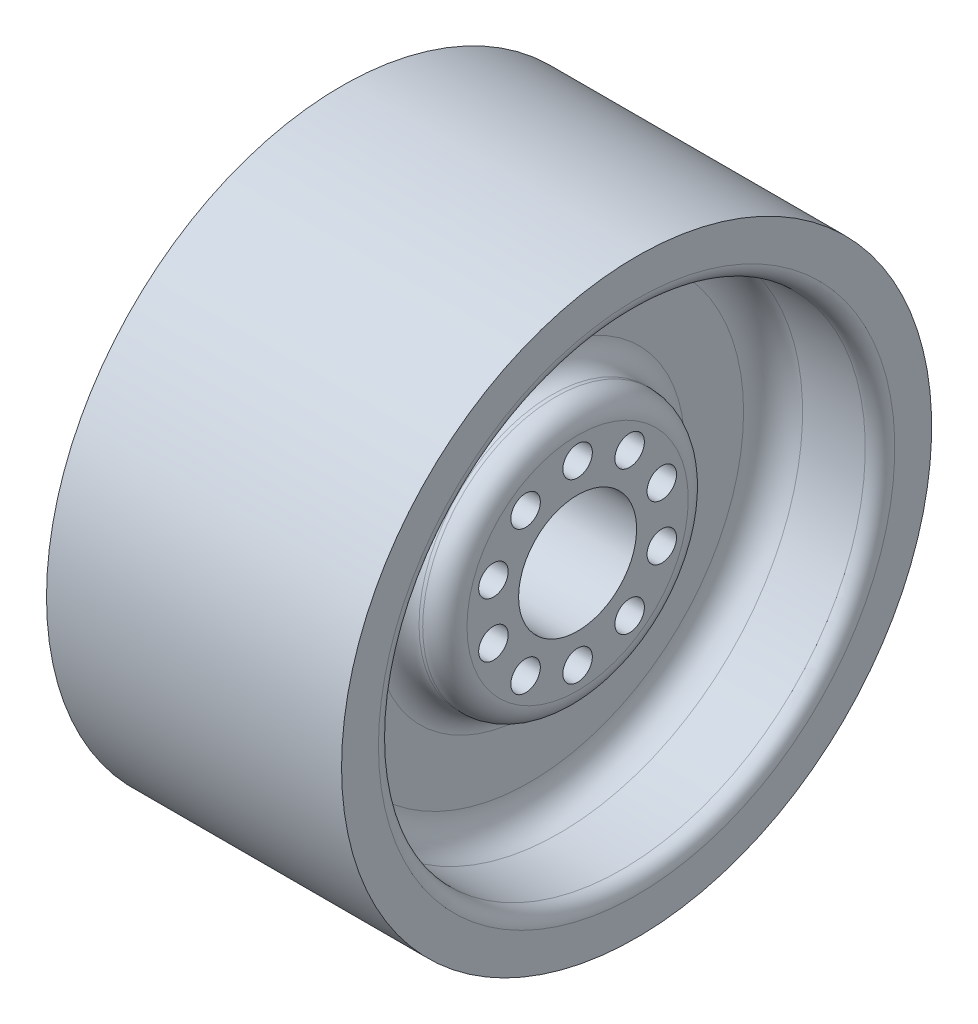
ISO-10303-21;
HEADER;
FILE_DESCRIPTION(('STEP AP214'),'2;1');
FILE_NAME('part.step','',(''),(''),'','','');
FILE_SCHEMA(('AUTOMOTIVE_DESIGN { 1 0 10303 214 1 1 1 1 }'));
ENDSEC;
DATA;
#1=APPLICATION_CONTEXT('core data for automotive mechanical design processes');
#2=APPLICATION_PROTOCOL_DEFINITION('international standard','automotive_design',2000,#1);
#3=PRODUCT_CONTEXT('',#1,'mechanical');
#4=PRODUCT('Part','Part','',(#3));
#5=PRODUCT_RELATED_PRODUCT_CATEGORY('part','',(#4));
#6=PRODUCT_DEFINITION_FORMATION('','',#4);
#7=PRODUCT_DEFINITION_CONTEXT('part definition',#1,'design');
#8=PRODUCT_DEFINITION('design','',#6,#7);
#9=PRODUCT_DEFINITION_SHAPE('','',#8);
#10=(LENGTH_UNIT() NAMED_UNIT(*) SI_UNIT(.MILLI.,.METRE.));
#11=(NAMED_UNIT(*) PLANE_ANGLE_UNIT() SI_UNIT($,.RADIAN.));
#12=(NAMED_UNIT(*) SI_UNIT($,.STERADIAN.) SOLID_ANGLE_UNIT());
#13=UNCERTAINTY_MEASURE_WITH_UNIT(LENGTH_MEASURE(1.E-05),#10,'distance_accuracy_value','');
#14=(GEOMETRIC_REPRESENTATION_CONTEXT(3) GLOBAL_UNCERTAINTY_ASSIGNED_CONTEXT((#13)) GLOBAL_UNIT_ASSIGNED_CONTEXT((#10,
#11,#12)) REPRESENTATION_CONTEXT('',''));
#15=CARTESIAN_POINT('',(0.,0.,0.));
#16=DIRECTION('',(0.,0.,1.));
#17=DIRECTION('',(1.,0.,0.));
#18=AXIS2_PLACEMENT_3D('',#15,#16,#17);
#19=CARTESIAN_POINT('',(40.,0.,0.));
#20=DIRECTION('',(-1.,0.,0.));
#21=DIRECTION('',(0.,0.,1.));
#22=AXIS2_PLACEMENT_3D('',#19,#20,#21);
#23=CYLINDRICAL_SURFACE('',#22,200.001);
#24=CARTESIAN_POINT('',(0.,0.,0.));
#25=DIRECTION('',(-1.,0.,0.));
#26=DIRECTION('',(0.,0.,1.));
#27=AXIS2_PLACEMENT_3D('',#24,#25,#26);
#28=CIRCLE('',#27,200.001);
#29=CARTESIAN_POINT('',(0.,0.,200.001));
#30=VERTEX_POINT('',#29);
#31=EDGE_CURVE('E10',#30,#30,#28,.T.);
#32=ORIENTED_EDGE('',*,*,#31,.F.);
#33=EDGE_LOOP('',(#32));
#34=FACE_BOUND('',#33,.T.);
#35=CARTESIAN_POINT('',(200.,0.,0.));
#36=DIRECTION('',(-1.,0.,0.));
#37=DIRECTION('',(0.,0.,1.));
#38=AXIS2_PLACEMENT_3D('',#35,#36,#37);
#39=CIRCLE('',#38,200.001);
#40=CARTESIAN_POINT('',(200.,0.,200.001));
#41=VERTEX_POINT('',#40);
#42=EDGE_CURVE('E98',#41,#41,#39,.T.);
#43=ORIENTED_EDGE('',*,*,#42,.T.);
#44=EDGE_LOOP('',(#43));
#45=FACE_BOUND('',#44,.T.);
#46=ADVANCED_FACE('F37',(#34,#45),#23,.T.);
#47=CARTESIAN_POINT('',(0.,200.001,0.));
#48=DIRECTION('',(1.,0.,0.));
#49=DIRECTION('',(0.,0.,-1.));
#50=AXIS2_PLACEMENT_3D('',#47,#48,#49);
#51=PLANE('',#50);
#52=CARTESIAN_POINT('',(0.,0.,0.));
#53=DIRECTION('',(-1.,0.,0.));
#54=DIRECTION('',(0.,0.,1.));
#55=AXIS2_PLACEMENT_3D('',#52,#53,#54);
#56=CIRCLE('',#55,175.001);
#57=CARTESIAN_POINT('',(0.,0.,175.001));
#58=VERTEX_POINT('',#57);
#59=EDGE_CURVE('E45',#58,#58,#56,.T.);
#60=ORIENTED_EDGE('',*,*,#59,.F.);
#61=EDGE_LOOP('',(#60));
#62=FACE_BOUND('',#61,.T.);
#63=ORIENTED_EDGE('',*,*,#31,.T.);
#64=EDGE_LOOP('',(#63));
#65=FACE_BOUND('',#64,.T.);
#66=ADVANCED_FACE('F173',(#62,#65),#51,.F.);
#67=CARTESIAN_POINT('',(10.,0.,0.));
#68=DIRECTION('',(-1.,0.,0.));
#69=DIRECTION('',(0.,0.,1.));
#70=AXIS2_PLACEMENT_3D('',#67,#68,#69);
#71=TOROIDAL_SURFACE('',#70,175.001,10.);
#72=CARTESIAN_POINT('',(10.,0.,0.));
#73=DIRECTION('',(-1.,0.,0.));
#74=DIRECTION('',(0.,0.,1.));
#75=AXIS2_PLACEMENT_3D('',#72,#73,#74);
#76=CIRCLE('',#75,165.001);
#77=CARTESIAN_POINT('',(10.,0.,165.001));
#78=VERTEX_POINT('',#77);
#79=EDGE_CURVE('E51',#78,#78,#76,.T.);
#80=ORIENTED_EDGE('',*,*,#79,.F.);
#81=EDGE_LOOP('',(#80));
#82=FACE_BOUND('',#81,.T.);
#83=ORIENTED_EDGE('',*,*,#59,.T.);
#84=EDGE_LOOP('',(#83));
#85=FACE_BOUND('',#84,.T.);
#86=ADVANCED_FACE('F170',(#82,#85),#71,.T.);
#87=CARTESIAN_POINT('',(40.,0.,0.));
#88=DIRECTION('',(-1.,0.,0.));
#89=DIRECTION('',(0.,0.,1.));
#90=AXIS2_PLACEMENT_3D('',#87,#88,#89);
#91=CYLINDRICAL_SURFACE('',#90,165.001);
#92=CARTESIAN_POINT('',(52.5,0.,0.));
#93=DIRECTION('',(-1.,0.,0.));
#94=DIRECTION('',(0.,0.,1.));
#95=AXIS2_PLACEMENT_3D('',#92,#93,#94);
#96=CIRCLE('',#95,165.001);
#97=CARTESIAN_POINT('',(52.5,0.,165.001));
#98=VERTEX_POINT('',#97);
#99=EDGE_CURVE('E161',#98,#98,#96,.T.);
#100=ORIENTED_EDGE('',*,*,#99,.F.);
#101=EDGE_LOOP('',(#100));
#102=FACE_BOUND('',#101,.T.);
#103=ORIENTED_EDGE('',*,*,#79,.T.);
#104=EDGE_LOOP('',(#103));
#105=FACE_BOUND('',#104,.T.);
#106=ADVANCED_FACE('F168',(#102,#105),#91,.F.);
#107=CARTESIAN_POINT('',(52.5,0.,0.));
#108=DIRECTION('',(-1.,0.,0.));
#109=DIRECTION('',(0.,0.,1.));
#110=AXIS2_PLACEMENT_3D('',#107,#108,#109);
#111=TOROIDAL_SURFACE('',#110,145.001,20.);
#112=CARTESIAN_POINT('',(72.5,0.,0.));
#113=DIRECTION('',(-1.,0.,0.));
#114=DIRECTION('',(0.,0.,1.));
#115=AXIS2_PLACEMENT_3D('',#112,#113,#114);
#116=CIRCLE('',#115,145.001);
#117=CARTESIAN_POINT('',(72.5,0.,145.001));
#118=VERTEX_POINT('',#117);
#119=EDGE_CURVE('E157',#118,#118,#116,.T.);
#120=ORIENTED_EDGE('',*,*,#119,.F.);
#121=EDGE_LOOP('',(#120));
#122=FACE_BOUND('',#121,.T.);
#123=ORIENTED_EDGE('',*,*,#99,.T.);
#124=EDGE_LOOP('',(#123));
#125=FACE_BOUND('',#124,.T.);
#126=ADVANCED_FACE('F185',(#122,#125),#111,.F.);
#127=CARTESIAN_POINT('',(72.5,145.001,0.));
#128=DIRECTION('',(1.,0.,0.));
#129=DIRECTION('',(0.,0.,-1.));
#130=AXIS2_PLACEMENT_3D('',#127,#128,#129);
#131=PLANE('',#130);
#132=CARTESIAN_POINT('',(72.4999999999999,0.,0.));
#133=DIRECTION('',(-1.,0.,0.));
#134=DIRECTION('',(0.,0.,1.));
#135=AXIS2_PLACEMENT_3D('',#132,#133,#134);
#136=CIRCLE('',#135,105.);
#137=CARTESIAN_POINT('',(72.4999999999999,0.,105.));
#138=VERTEX_POINT('',#137);
#139=EDGE_CURVE('E153',#138,#138,#136,.T.);
#140=ORIENTED_EDGE('',*,*,#139,.F.);
#141=EDGE_LOOP('',(#140));
#142=FACE_BOUND('',#141,.T.);
#143=ORIENTED_EDGE('',*,*,#119,.T.);
#144=EDGE_LOOP('',(#143));
#145=FACE_BOUND('',#144,.T.);
#146=ADVANCED_FACE('F189',(#142,#145),#131,.F.);
#147=CARTESIAN_POINT('',(57.4999999999999,0.,0.));
#148=DIRECTION('',(-1.,0.,0.));
#149=DIRECTION('',(0.,0.,1.));
#150=AXIS2_PLACEMENT_3D('',#147,#148,#149);
#151=TOROIDAL_SURFACE('',#150,105.,15.);
#152=CARTESIAN_POINT('',(57.4999999999999,0.,0.));
#153=DIRECTION('',(-1.,0.,0.));
#154=DIRECTION('',(0.,0.,1.));
#155=AXIS2_PLACEMENT_3D('',#152,#153,#154);
#156=CIRCLE('',#155,90.);
#157=CARTESIAN_POINT('',(57.4999999999999,0.,90.));
#158=VERTEX_POINT('',#157);
#159=EDGE_CURVE('E149',#158,#158,#156,.T.);
#160=ORIENTED_EDGE('',*,*,#159,.F.);
#161=EDGE_LOOP('',(#160));
#162=FACE_BOUND('',#161,.T.);
#163=ORIENTED_EDGE('',*,*,#139,.T.);
#164=EDGE_LOOP('',(#163));
#165=FACE_BOUND('',#164,.T.);
#166=ADVANCED_FACE('F193',(#162,#165),#151,.F.);
#167=CARTESIAN_POINT('',(40.,0.,0.));
#168=DIRECTION('',(-1.,0.,0.));
#169=DIRECTION('',(0.,0.,1.));
#170=AXIS2_PLACEMENT_3D('',#167,#168,#169);
#171=CYLINDRICAL_SURFACE('',#170,90.);
#172=CARTESIAN_POINT('',(55.,0.,0.));
#173=DIRECTION('',(-1.,0.,0.));
#174=DIRECTION('',(0.,0.,1.));
#175=AXIS2_PLACEMENT_3D('',#172,#173,#174);
#176=CIRCLE('',#175,90.);
#177=CARTESIAN_POINT('',(55.,0.,90.));
#178=VERTEX_POINT('',#177);
#179=EDGE_CURVE('E145',#178,#178,#176,.T.);
#180=ORIENTED_EDGE('',*,*,#179,.F.);
#181=EDGE_LOOP('',(#180));
#182=FACE_BOUND('',#181,.T.);
#183=ORIENTED_EDGE('',*,*,#159,.T.);
#184=EDGE_LOOP('',(#183));
#185=FACE_BOUND('',#184,.T.);
#186=ADVANCED_FACE('F197',(#182,#185),#171,.T.);
#187=CARTESIAN_POINT('',(55.,0.,0.));
#188=DIRECTION('',(-1.,0.,0.));
#189=DIRECTION('',(0.,0.,1.));
#190=AXIS2_PLACEMENT_3D('',#187,#188,#189);
#191=TOROIDAL_SURFACE('',#190,75.,15.);
#192=CARTESIAN_POINT('',(40.,0.,0.));
#193=DIRECTION('',(-1.,0.,0.));
#194=DIRECTION('',(0.,0.,1.));
#195=AXIS2_PLACEMENT_3D('',#192,#193,#194);
#196=CIRCLE('',#195,75.);
#197=CARTESIAN_POINT('',(40.,0.,75.));
#198=VERTEX_POINT('',#197);
#199=EDGE_CURVE('E141',#198,#198,#196,.T.);
#200=ORIENTED_EDGE('',*,*,#199,.F.);
#201=EDGE_LOOP('',(#200));
#202=FACE_BOUND('',#201,.T.);
#203=ORIENTED_EDGE('',*,*,#179,.T.);
#204=EDGE_LOOP('',(#203));
#205=FACE_BOUND('',#204,.T.);
#206=ADVANCED_FACE('F201',(#202,#205),#191,.T.);
#207=CARTESIAN_POINT('',(40.,75.,0.));
#208=DIRECTION('',(1.,0.,0.));
#209=DIRECTION('',(0.,0.,-1.));
#210=AXIS2_PLACEMENT_3D('',#207,#208,#209);
#211=PLANE('',#210);
#212=CARTESIAN_POINT('',(40.,-18.5410196624978,-57.0633909777089));
#213=DIRECTION('',(-1.,0.,0.));
#214=DIRECTION('',(0.,0.,1.));
#215=AXIS2_PLACEMENT_3D('',#212,#213,#214);
#216=CIRCLE('',#215,10.0000000000015);
#217=CARTESIAN_POINT('',(40.,-18.5410196624978,-47.0633909777074));
#218=VERTEX_POINT('',#217);
#219=EDGE_CURVE('E307',#218,#218,#216,.T.);
#220=ORIENTED_EDGE('',*,*,#219,.F.);
#221=EDGE_LOOP('',(#220));
#222=FACE_BOUND('',#221,.T.);
#223=CARTESIAN_POINT('',(40.,-48.5410196624977,-35.267115137548));
#224=DIRECTION('',(-1.,0.,0.));
#225=DIRECTION('',(0.,0.,1.));
#226=AXIS2_PLACEMENT_3D('',#223,#224,#225);
#227=CIRCLE('',#226,10.0000000000012);
#228=CARTESIAN_POINT('',(40.,-48.5410196624977,-25.2671151375468));
#229=VERTEX_POINT('',#228);
#230=EDGE_CURVE('E313',#229,#229,#227,.T.);
#231=ORIENTED_EDGE('',*,*,#230,.F.);
#232=EDGE_LOOP('',(#231));
#233=FACE_BOUND('',#232,.T.);
#234=CARTESIAN_POINT('',(40.,-60.0000000000008,4.7990859588068E-13));
#235=DIRECTION('',(-1.,0.,0.));
#236=DIRECTION('',(0.,0.,1.));
#237=AXIS2_PLACEMENT_3D('',#234,#235,#236);
#238=CIRCLE('',#237,10.0000000000006);
#239=CARTESIAN_POINT('',(40.,-60.0000000000008,10.0000000000011));
#240=VERTEX_POINT('',#239);
#241=EDGE_CURVE('E323',#240,#240,#238,.T.);
#242=ORIENTED_EDGE('',*,*,#241,.F.);
#243=EDGE_LOOP('',(#242));
#244=FACE_BOUND('',#243,.T.);
#245=CARTESIAN_POINT('',(40.,-48.5410196624981,35.2671151375493));
#246=DIRECTION('',(-1.,0.,0.));
#247=DIRECTION('',(0.,0.,1.));
#248=AXIS2_PLACEMENT_3D('',#245,#246,#247);
#249=CIRCLE('',#248,9.99999999999988);
#250=CARTESIAN_POINT('',(40.,-48.5410196624981,45.2671151375491));
#251=VERTEX_POINT('',#250);
#252=EDGE_CURVE('E318',#251,#251,#249,.T.);
#253=ORIENTED_EDGE('',*,*,#252,.F.);
#254=EDGE_LOOP('',(#253));
#255=FACE_BOUND('',#254,.T.);
#256=CARTESIAN_POINT('',(40.,-18.5410196624974,57.0633909777095));
#257=DIRECTION('',(-1.,0.,0.));
#258=DIRECTION('',(0.,0.,1.));
#259=AXIS2_PLACEMENT_3D('',#256,#257,#258);
#260=CIRCLE('',#259,9.99999999999973);
#261=CARTESIAN_POINT('',(40.,-18.5410196624974,67.0633909777092));
#262=VERTEX_POINT('',#261);
#263=EDGE_CURVE('E322',#262,#262,#260,.T.);
#264=ORIENTED_EDGE('',*,*,#263,.F.);
#265=EDGE_LOOP('',(#264));
#266=FACE_BOUND('',#265,.T.);
#267=CARTESIAN_POINT('',(40.,18.5410196624963,57.0633909777094));
#268=DIRECTION('',(-1.,0.,0.));
#269=DIRECTION('',(0.,0.,1.));
#270=AXIS2_PLACEMENT_3D('',#267,#268,#269);
#271=CIRCLE('',#270,9.99999999999963);
#272=CARTESIAN_POINT('',(40.,18.5410196624963,67.063390977709));
#273=VERTEX_POINT('',#272);
#274=EDGE_CURVE('E338',#273,#273,#271,.T.);
#275=ORIENTED_EDGE('',*,*,#274,.F.);
#276=EDGE_LOOP('',(#275));
#277=FACE_BOUND('',#276,.T.);
#278=CARTESIAN_POINT('',(40.,48.5410196624962,35.2671151375484));
#279=DIRECTION('',(-1.,0.,0.));
#280=DIRECTION('',(0.,0.,1.));
#281=AXIS2_PLACEMENT_3D('',#278,#279,#280);
#282=CIRCLE('',#281,9.99999999999983);
#283=CARTESIAN_POINT('',(40.,48.5410196624962,45.2671151375483));
#284=VERTEX_POINT('',#283);
#285=EDGE_CURVE('E334',#284,#284,#282,.T.);
#286=ORIENTED_EDGE('',*,*,#285,.F.);
#287=EDGE_LOOP('',(#286));
#288=FACE_BOUND('',#287,.T.);
#289=CARTESIAN_POINT('',(40.,59.9999999999992,0.));
#290=DIRECTION('',(-1.,0.,0.));
#291=DIRECTION('',(0.,0.,1.));
#292=AXIS2_PLACEMENT_3D('',#289,#290,#291);
#293=CIRCLE('',#292,10.0000000000002);
#294=CARTESIAN_POINT('',(40.,59.9999999999992,10.0000000000002));
#295=VERTEX_POINT('',#294);
#296=EDGE_CURVE('E330',#295,#295,#293,.T.);
#297=ORIENTED_EDGE('',*,*,#296,.F.);
#298=EDGE_LOOP('',(#297));
#299=FACE_BOUND('',#298,.T.);
#300=CARTESIAN_POINT('',(40.,18.5410196624959,-57.063390977709));
#301=DIRECTION('',(-1.,0.,0.));
#302=DIRECTION('',(0.,0.,1.));
#303=AXIS2_PLACEMENT_3D('',#300,#301,#302);
#304=CIRCLE('',#303,10.0000000000016);
#305=CARTESIAN_POINT('',(40.,18.5410196624959,-47.0633909777074));
#306=VERTEX_POINT('',#305);
#307=EDGE_CURVE('E293',#306,#306,#304,.T.);
#308=ORIENTED_EDGE('',*,*,#307,.F.);
#309=EDGE_LOOP('',(#308));
#310=FACE_BOUND('',#309,.T.);
#311=CARTESIAN_POINT('',(40.,48.5410196624968,-35.2671151375484));
#312=DIRECTION('',(-1.,0.,0.));
#313=DIRECTION('',(0.,0.,1.));
#314=AXIS2_PLACEMENT_3D('',#311,#312,#313);
#315=CIRCLE('',#314,10.0000000000008);
#316=CARTESIAN_POINT('',(40.,48.5410196624968,-25.2671151375476));
#317=VERTEX_POINT('',#316);
#318=EDGE_CURVE('E308',#317,#317,#315,.T.);
#319=ORIENTED_EDGE('',*,*,#318,.F.);
#320=EDGE_LOOP('',(#319));
#321=FACE_BOUND('',#320,.T.);
#322=CARTESIAN_POINT('',(40.,0.,0.));
#323=DIRECTION('',(-1.,0.,0.));
#324=DIRECTION('',(0.,0.,1.));
#325=AXIS2_PLACEMENT_3D('',#322,#323,#324);
#326=CIRCLE('',#325,40.);
#327=CARTESIAN_POINT('',(40.,0.,40.));
#328=VERTEX_POINT('',#327);
#329=EDGE_CURVE('E60',#328,#328,#326,.T.);
#330=ORIENTED_EDGE('',*,*,#329,.F.);
#331=EDGE_LOOP('',(#330));
#332=FACE_BOUND('',#331,.T.);
#333=ORIENTED_EDGE('',*,*,#199,.T.);
#334=EDGE_LOOP('',(#333));
#335=FACE_BOUND('',#334,.T.);
#336=ADVANCED_FACE('F205',(#222,#233,#244,#255,#266,#277,#288,#299,#310,#321,#332,#335),#211,.F.);
#337=CARTESIAN_POINT('',(160.,75.,0.));
#338=DIRECTION('',(-1.,0.,0.));
#339=DIRECTION('',(0.,0.,1.));
#340=AXIS2_PLACEMENT_3D('',#337,#338,#339);
#341=PLANE('',#340);
#342=CARTESIAN_POINT('',(160.,-18.5410196624978,-57.0633909777089));
#343=DIRECTION('',(-1.,0.,0.));
#344=DIRECTION('',(0.,0.,1.));
#345=AXIS2_PLACEMENT_3D('',#342,#343,#344);
#346=CIRCLE('',#345,10.0000000000015);
#347=CARTESIAN_POINT('',(160.,-18.5410196624978,-47.0633909777074));
#348=VERTEX_POINT('',#347);
#349=EDGE_CURVE('E40',#348,#348,#346,.T.);
#350=ORIENTED_EDGE('',*,*,#349,.T.);
#351=EDGE_LOOP('',(#350));
#352=FACE_BOUND('',#351,.T.);
#353=CARTESIAN_POINT('',(160.,-48.5410196624977,-35.267115137548));
#354=DIRECTION('',(-1.,0.,0.));
#355=DIRECTION('',(0.,0.,1.));
#356=AXIS2_PLACEMENT_3D('',#353,#354,#355);
#357=CIRCLE('',#356,10.0000000000012);
#358=CARTESIAN_POINT('',(160.,-48.5410196624977,-25.2671151375468));
#359=VERTEX_POINT('',#358);
#360=EDGE_CURVE('E91',#359,#359,#357,.T.);
#361=ORIENTED_EDGE('',*,*,#360,.T.);
#362=EDGE_LOOP('',(#361));
#363=FACE_BOUND('',#362,.T.);
#364=CARTESIAN_POINT('',(160.,-60.0000000000008,4.7990859588068E-13));
#365=DIRECTION('',(-1.,0.,0.));
#366=DIRECTION('',(0.,0.,1.));
#367=AXIS2_PLACEMENT_3D('',#364,#365,#366);
#368=CIRCLE('',#367,10.0000000000006);
#369=CARTESIAN_POINT('',(160.,-60.0000000000008,10.0000000000011));
#370=VERTEX_POINT('',#369);
#371=EDGE_CURVE('E88',#370,#370,#368,.T.);
#372=ORIENTED_EDGE('',*,*,#371,.T.);
#373=EDGE_LOOP('',(#372));
#374=FACE_BOUND('',#373,.T.);
#375=CARTESIAN_POINT('',(160.,-48.5410196624981,35.2671151375493));
#376=DIRECTION('',(-1.,0.,0.));
#377=DIRECTION('',(0.,0.,1.));
#378=AXIS2_PLACEMENT_3D('',#375,#376,#377);
#379=CIRCLE('',#378,9.99999999999988);
#380=CARTESIAN_POINT('',(160.,-48.5410196624981,45.2671151375491));
#381=VERTEX_POINT('',#380);
#382=EDGE_CURVE('E84',#381,#381,#379,.T.);
#383=ORIENTED_EDGE('',*,*,#382,.T.);
#384=EDGE_LOOP('',(#383));
#385=FACE_BOUND('',#384,.T.);
#386=CARTESIAN_POINT('',(160.,-18.5410196624974,57.0633909777095));
#387=DIRECTION('',(-1.,0.,0.));
#388=DIRECTION('',(0.,0.,1.));
#389=AXIS2_PLACEMENT_3D('',#386,#387,#388);
#390=CIRCLE('',#389,9.99999999999973);
#391=CARTESIAN_POINT('',(160.,-18.5410196624974,67.0633909777092));
#392=VERTEX_POINT('',#391);
#393=EDGE_CURVE('E80',#392,#392,#390,.T.);
#394=ORIENTED_EDGE('',*,*,#393,.T.);
#395=EDGE_LOOP('',(#394));
#396=FACE_BOUND('',#395,.T.);
#397=CARTESIAN_POINT('',(160.,18.5410196624963,57.0633909777094));
#398=DIRECTION('',(-1.,0.,0.));
#399=DIRECTION('',(0.,0.,1.));
#400=AXIS2_PLACEMENT_3D('',#397,#398,#399);
#401=CIRCLE('',#400,9.99999999999963);
#402=CARTESIAN_POINT('',(160.,18.5410196624963,67.063390977709));
#403=VERTEX_POINT('',#402);
#404=EDGE_CURVE('E76',#403,#403,#401,.T.);
#405=ORIENTED_EDGE('',*,*,#404,.T.);
#406=EDGE_LOOP('',(#405));
#407=FACE_BOUND('',#406,.T.);
#408=CARTESIAN_POINT('',(160.,48.5410196624962,35.2671151375484));
#409=DIRECTION('',(-1.,0.,0.));
#410=DIRECTION('',(0.,0.,1.));
#411=AXIS2_PLACEMENT_3D('',#408,#409,#410);
#412=CIRCLE('',#411,9.99999999999983);
#413=CARTESIAN_POINT('',(160.,48.5410196624962,45.2671151375483));
#414=VERTEX_POINT('',#413);
#415=EDGE_CURVE('E72',#414,#414,#412,.T.);
#416=ORIENTED_EDGE('',*,*,#415,.T.);
#417=EDGE_LOOP('',(#416));
#418=FACE_BOUND('',#417,.T.);
#419=CARTESIAN_POINT('',(160.,59.9999999999992,0.));
#420=DIRECTION('',(-1.,0.,0.));
#421=DIRECTION('',(0.,0.,1.));
#422=AXIS2_PLACEMENT_3D('',#419,#420,#421);
#423=CIRCLE('',#422,10.0000000000002);
#424=CARTESIAN_POINT('',(160.,59.9999999999992,10.0000000000002));
#425=VERTEX_POINT('',#424);
#426=EDGE_CURVE('E68',#425,#425,#423,.T.);
#427=ORIENTED_EDGE('',*,*,#426,.T.);
#428=EDGE_LOOP('',(#427));
#429=FACE_BOUND('',#428,.T.);
#430=CARTESIAN_POINT('',(160.,18.5410196624959,-57.063390977709));
#431=DIRECTION('',(-1.,0.,0.));
#432=DIRECTION('',(0.,0.,1.));
#433=AXIS2_PLACEMENT_3D('',#430,#431,#432);
#434=CIRCLE('',#433,10.0000000000016);
#435=CARTESIAN_POINT('',(160.,18.5410196624959,-47.0633909777074));
#436=VERTEX_POINT('',#435);
#437=EDGE_CURVE('E64',#436,#436,#434,.T.);
#438=ORIENTED_EDGE('',*,*,#437,.T.);
#439=EDGE_LOOP('',(#438));
#440=FACE_BOUND('',#439,.T.);
#441=CARTESIAN_POINT('',(160.,48.5410196624968,-35.2671151375484));
#442=DIRECTION('',(-1.,0.,0.));
#443=DIRECTION('',(0.,0.,1.));
#444=AXIS2_PLACEMENT_3D('',#441,#442,#443);
#445=CIRCLE('',#444,10.0000000000008);
#446=CARTESIAN_POINT('',(160.,48.5410196624968,-25.2671151375476));
#447=VERTEX_POINT('',#446);
#448=EDGE_CURVE('E59',#447,#447,#445,.T.);
#449=ORIENTED_EDGE('',*,*,#448,.T.);
#450=EDGE_LOOP('',(#449));
#451=FACE_BOUND('',#450,.T.);
#452=CARTESIAN_POINT('',(160.,0.,0.));
#453=DIRECTION('',(-1.,0.,0.));
#454=DIRECTION('',(0.,0.,1.));
#455=AXIS2_PLACEMENT_3D('',#452,#453,#454);
#456=CIRCLE('',#455,40.);
#457=CARTESIAN_POINT('',(160.,0.,40.));
#458=VERTEX_POINT('',#457);
#459=EDGE_CURVE('E55',#458,#458,#456,.T.);
#460=ORIENTED_EDGE('',*,*,#459,.T.);
#461=EDGE_LOOP('',(#460));
#462=FACE_BOUND('',#461,.T.);
#463=CARTESIAN_POINT('',(160.,0.,0.));
#464=DIRECTION('',(-1.,0.,0.));
#465=DIRECTION('',(0.,0.,1.));
#466=AXIS2_PLACEMENT_3D('',#463,#464,#465);
#467=CIRCLE('',#466,75.);
#468=CARTESIAN_POINT('',(160.,0.,75.));
#469=VERTEX_POINT('',#468);
#470=EDGE_CURVE('E137',#469,#469,#467,.T.);
#471=ORIENTED_EDGE('',*,*,#470,.F.);
#472=EDGE_LOOP('',(#471));
#473=FACE_BOUND('',#472,.T.);
#474=ADVANCED_FACE('F209',(#352,#363,#374,#385,#396,#407,#418,#429,#440,#451,#462,#473),#341,.F.);
#475=CARTESIAN_POINT('',(145.,0.,0.));
#476=DIRECTION('',(-1.,0.,0.));
#477=DIRECTION('',(0.,0.,1.));
#478=AXIS2_PLACEMENT_3D('',#475,#476,#477);
#479=TOROIDAL_SURFACE('',#478,75.,15.);
#480=CARTESIAN_POINT('',(145.,0.,0.));
#481=DIRECTION('',(-1.,0.,0.));
#482=DIRECTION('',(0.,0.,1.));
#483=AXIS2_PLACEMENT_3D('',#480,#481,#482);
#484=CIRCLE('',#483,90.);
#485=CARTESIAN_POINT('',(145.,0.,90.));
#486=VERTEX_POINT('',#485);
#487=EDGE_CURVE('E133',#486,#486,#484,.T.);
#488=ORIENTED_EDGE('',*,*,#487,.F.);
#489=EDGE_LOOP('',(#488));
#490=FACE_BOUND('',#489,.T.);
#491=ORIENTED_EDGE('',*,*,#470,.T.);
#492=EDGE_LOOP('',(#491));
#493=FACE_BOUND('',#492,.T.);
#494=ADVANCED_FACE('F213',(#490,#493),#479,.T.);
#495=CARTESIAN_POINT('',(40.,0.,0.));
#496=DIRECTION('',(-1.,0.,0.));
#497=DIRECTION('',(0.,0.,1.));
#498=AXIS2_PLACEMENT_3D('',#495,#496,#497);
#499=CYLINDRICAL_SURFACE('',#498,90.);
#500=CARTESIAN_POINT('',(142.5,0.,0.));
#501=DIRECTION('',(-1.,0.,0.));
#502=DIRECTION('',(0.,0.,1.));
#503=AXIS2_PLACEMENT_3D('',#500,#501,#502);
#504=CIRCLE('',#503,90.);
#505=CARTESIAN_POINT('',(142.5,0.,90.));
#506=VERTEX_POINT('',#505);
#507=EDGE_CURVE('E129',#506,#506,#504,.T.);
#508=ORIENTED_EDGE('',*,*,#507,.F.);
#509=EDGE_LOOP('',(#508));
#510=FACE_BOUND('',#509,.T.);
#511=ORIENTED_EDGE('',*,*,#487,.T.);
#512=EDGE_LOOP('',(#511));
#513=FACE_BOUND('',#512,.T.);
#514=ADVANCED_FACE('F216',(#510,#513),#499,.T.);
#515=CARTESIAN_POINT('',(142.5,0.,0.));
#516=DIRECTION('',(-1.,0.,0.));
#517=DIRECTION('',(0.,0.,1.));
#518=AXIS2_PLACEMENT_3D('',#515,#516,#517);
#519=TOROIDAL_SURFACE('',#518,105.,15.);
#520=CARTESIAN_POINT('',(127.5,0.,0.));
#521=DIRECTION('',(-1.,0.,0.));
#522=DIRECTION('',(0.,0.,1.));
#523=AXIS2_PLACEMENT_3D('',#520,#521,#522);
#524=CIRCLE('',#523,105.);
#525=CARTESIAN_POINT('',(127.5,0.,105.));
#526=VERTEX_POINT('',#525);
#527=EDGE_CURVE('E125',#526,#526,#524,.T.);
#528=ORIENTED_EDGE('',*,*,#527,.F.);
#529=EDGE_LOOP('',(#528));
#530=FACE_BOUND('',#529,.T.);
#531=ORIENTED_EDGE('',*,*,#507,.T.);
#532=EDGE_LOOP('',(#531));
#533=FACE_BOUND('',#532,.T.);
#534=ADVANCED_FACE('F220',(#530,#533),#519,.F.);
#535=CARTESIAN_POINT('',(127.5,145.001,0.));
#536=DIRECTION('',(-1.,0.,0.));
#537=DIRECTION('',(0.,0.,1.));
#538=AXIS2_PLACEMENT_3D('',#535,#536,#537);
#539=PLANE('',#538);
#540=CARTESIAN_POINT('',(127.5,0.,0.));
#541=DIRECTION('',(-1.,0.,0.));
#542=DIRECTION('',(0.,0.,1.));
#543=AXIS2_PLACEMENT_3D('',#540,#541,#542);
#544=CIRCLE('',#543,145.001);
#545=CARTESIAN_POINT('',(127.5,0.,145.001));
#546=VERTEX_POINT('',#545);
#547=EDGE_CURVE('E121',#546,#546,#544,.T.);
#548=ORIENTED_EDGE('',*,*,#547,.F.);
#549=EDGE_LOOP('',(#548));
#550=FACE_BOUND('',#549,.T.);
#551=ORIENTED_EDGE('',*,*,#527,.T.);
#552=EDGE_LOOP('',(#551));
#553=FACE_BOUND('',#552,.T.);
#554=ADVANCED_FACE('F224',(#550,#553),#539,.F.);
#555=CARTESIAN_POINT('',(147.5,0.,0.));
#556=DIRECTION('',(-1.,0.,0.));
#557=DIRECTION('',(0.,0.,1.));
#558=AXIS2_PLACEMENT_3D('',#555,#556,#557);
#559=TOROIDAL_SURFACE('',#558,145.001,20.);
#560=CARTESIAN_POINT('',(147.5,0.,0.));
#561=DIRECTION('',(-1.,0.,0.));
#562=DIRECTION('',(0.,0.,1.));
#563=AXIS2_PLACEMENT_3D('',#560,#561,#562);
#564=CIRCLE('',#563,165.001);
#565=CARTESIAN_POINT('',(147.5,0.,165.001));
#566=VERTEX_POINT('',#565);
#567=EDGE_CURVE('E117',#566,#566,#564,.T.);
#568=ORIENTED_EDGE('',*,*,#567,.F.);
#569=EDGE_LOOP('',(#568));
#570=FACE_BOUND('',#569,.T.);
#571=ORIENTED_EDGE('',*,*,#547,.T.);
#572=EDGE_LOOP('',(#571));
#573=FACE_BOUND('',#572,.T.);
#574=ADVANCED_FACE('F228',(#570,#573),#559,.F.);
#575=CARTESIAN_POINT('',(40.,0.,0.));
#576=DIRECTION('',(-1.,0.,0.));
#577=DIRECTION('',(0.,0.,1.));
#578=AXIS2_PLACEMENT_3D('',#575,#576,#577);
#579=CYLINDRICAL_SURFACE('',#578,165.001);
#580=CARTESIAN_POINT('',(190.,0.,0.));
#581=DIRECTION('',(-1.,0.,0.));
#582=DIRECTION('',(0.,0.,1.));
#583=AXIS2_PLACEMENT_3D('',#580,#581,#582);
#584=CIRCLE('',#583,165.001);
#585=CARTESIAN_POINT('',(190.,0.,165.001));
#586=VERTEX_POINT('',#585);
#587=EDGE_CURVE('E109',#586,#586,#584,.T.);
#588=ORIENTED_EDGE('',*,*,#587,.F.);
#589=EDGE_LOOP('',(#588));
#590=FACE_BOUND('',#589,.T.);
#591=ORIENTED_EDGE('',*,*,#567,.T.);
#592=EDGE_LOOP('',(#591));
#593=FACE_BOUND('',#592,.T.);
#594=ADVANCED_FACE('F232',(#590,#593),#579,.F.);
#595=CARTESIAN_POINT('',(190.,0.,0.));
#596=DIRECTION('',(-1.,0.,0.));
#597=DIRECTION('',(0.,0.,1.));
#598=AXIS2_PLACEMENT_3D('',#595,#596,#597);
#599=TOROIDAL_SURFACE('',#598,175.001,10.);
#600=CARTESIAN_POINT('',(200.,0.,0.));
#601=DIRECTION('',(-1.,0.,0.));
#602=DIRECTION('',(0.,0.,1.));
#603=AXIS2_PLACEMENT_3D('',#600,#601,#602);
#604=CIRCLE('',#603,175.001);
#605=CARTESIAN_POINT('',(200.,0.,175.001));
#606=VERTEX_POINT('',#605);
#607=EDGE_CURVE('E103',#606,#606,#604,.T.);
#608=ORIENTED_EDGE('',*,*,#607,.F.);
#609=EDGE_LOOP('',(#608));
#610=FACE_BOUND('',#609,.T.);
#611=ORIENTED_EDGE('',*,*,#587,.T.);
#612=EDGE_LOOP('',(#611));
#613=FACE_BOUND('',#612,.T.);
#614=ADVANCED_FACE('F236',(#610,#613),#599,.T.);
#615=CARTESIAN_POINT('',(200.,175.001,0.));
#616=DIRECTION('',(-1.,0.,0.));
#617=DIRECTION('',(0.,0.,1.));
#618=AXIS2_PLACEMENT_3D('',#615,#616,#617);
#619=PLANE('',#618);
#620=ORIENTED_EDGE('',*,*,#42,.F.);
#621=EDGE_LOOP('',(#620));
#622=FACE_BOUND('',#621,.T.);
#623=ORIENTED_EDGE('',*,*,#607,.T.);
#624=EDGE_LOOP('',(#623));
#625=FACE_BOUND('',#624,.T.);
#626=ADVANCED_FACE('F240',(#622,#625),#619,.F.);
#627=CARTESIAN_POINT('',(200.,0.,0.));
#628=DIRECTION('',(-1.,0.,0.));
#629=DIRECTION('',(0.,0.,1.));
#630=AXIS2_PLACEMENT_3D('',#627,#628,#629);
#631=CYLINDRICAL_SURFACE('',#630,40.);
#632=ORIENTED_EDGE('',*,*,#329,.T.);
#633=EDGE_LOOP('',(#632));
#634=FACE_BOUND('',#633,.T.);
#635=ORIENTED_EDGE('',*,*,#459,.F.);
#636=EDGE_LOOP('',(#635));
#637=FACE_BOUND('',#636,.T.);
#638=ADVANCED_FACE('F244',(#634,#637),#631,.F.);
#639=CARTESIAN_POINT('',(200.,48.5410196624968,-35.2671151375484));
#640=DIRECTION('',(-1.,0.,0.));
#641=DIRECTION('',(0.,0.,1.));
#642=AXIS2_PLACEMENT_3D('',#639,#640,#641);
#643=CYLINDRICAL_SURFACE('',#642,10.0000000000008);
#644=ORIENTED_EDGE('',*,*,#318,.T.);
#645=EDGE_LOOP('',(#644));
#646=FACE_BOUND('',#645,.T.);
#647=ORIENTED_EDGE('',*,*,#448,.F.);
#648=EDGE_LOOP('',(#647));
#649=FACE_BOUND('',#648,.T.);
#650=ADVANCED_FACE('F248',(#646,#649),#643,.F.);
#651=CARTESIAN_POINT('',(200.,18.5410196624959,-57.063390977709));
#652=DIRECTION('',(-1.,0.,0.));
#653=DIRECTION('',(0.,0.,1.));
#654=AXIS2_PLACEMENT_3D('',#651,#652,#653);
#655=CYLINDRICAL_SURFACE('',#654,10.0000000000016);
#656=ORIENTED_EDGE('',*,*,#307,.T.);
#657=EDGE_LOOP('',(#656));
#658=FACE_BOUND('',#657,.T.);
#659=ORIENTED_EDGE('',*,*,#437,.F.);
#660=EDGE_LOOP('',(#659));
#661=FACE_BOUND('',#660,.T.);
#662=ADVANCED_FACE('F266',(#658,#661),#655,.F.);
#663=CARTESIAN_POINT('',(200.,59.9999999999992,0.));
#664=DIRECTION('',(-1.,0.,0.));
#665=DIRECTION('',(0.,0.,1.));
#666=AXIS2_PLACEMENT_3D('',#663,#664,#665);
#667=CYLINDRICAL_SURFACE('',#666,10.0000000000002);
#668=ORIENTED_EDGE('',*,*,#296,.T.);
#669=EDGE_LOOP('',(#668));
#670=FACE_BOUND('',#669,.T.);
#671=ORIENTED_EDGE('',*,*,#426,.F.);
#672=EDGE_LOOP('',(#671));
#673=FACE_BOUND('',#672,.T.);
#674=ADVANCED_FACE('F262',(#670,#673),#667,.F.);
#675=CARTESIAN_POINT('',(200.,48.5410196624962,35.2671151375484));
#676=DIRECTION('',(-1.,0.,0.));
#677=DIRECTION('',(0.,0.,1.));
#678=AXIS2_PLACEMENT_3D('',#675,#676,#677);
#679=CYLINDRICAL_SURFACE('',#678,9.99999999999983);
#680=ORIENTED_EDGE('',*,*,#285,.T.);
#681=EDGE_LOOP('',(#680));
#682=FACE_BOUND('',#681,.T.);
#683=ORIENTED_EDGE('',*,*,#415,.F.);
#684=EDGE_LOOP('',(#683));
#685=FACE_BOUND('',#684,.T.);
#686=ADVANCED_FACE('F258',(#682,#685),#679,.F.);
#687=CARTESIAN_POINT('',(200.,18.5410196624963,57.0633909777094));
#688=DIRECTION('',(-1.,0.,0.));
#689=DIRECTION('',(0.,0.,1.));
#690=AXIS2_PLACEMENT_3D('',#687,#688,#689);
#691=CYLINDRICAL_SURFACE('',#690,9.99999999999963);
#692=ORIENTED_EDGE('',*,*,#274,.T.);
#693=EDGE_LOOP('',(#692));
#694=FACE_BOUND('',#693,.T.);
#695=ORIENTED_EDGE('',*,*,#404,.F.);
#696=EDGE_LOOP('',(#695));
#697=FACE_BOUND('',#696,.T.);
#698=ADVANCED_FACE('F254',(#694,#697),#691,.F.);
#699=CARTESIAN_POINT('',(200.,-18.5410196624974,57.0633909777095));
#700=DIRECTION('',(-1.,0.,0.));
#701=DIRECTION('',(0.,0.,1.));
#702=AXIS2_PLACEMENT_3D('',#699,#700,#701);
#703=CYLINDRICAL_SURFACE('',#702,9.99999999999973);
#704=ORIENTED_EDGE('',*,*,#263,.T.);
#705=EDGE_LOOP('',(#704));
#706=FACE_BOUND('',#705,.T.);
#707=ORIENTED_EDGE('',*,*,#393,.F.);
#708=EDGE_LOOP('',(#707));
#709=FACE_BOUND('',#708,.T.);
#710=ADVANCED_FACE('F250',(#706,#709),#703,.F.);
#711=CARTESIAN_POINT('',(200.,-48.5410196624981,35.2671151375493));
#712=DIRECTION('',(-1.,0.,0.));
#713=DIRECTION('',(0.,0.,1.));
#714=AXIS2_PLACEMENT_3D('',#711,#712,#713);
#715=CYLINDRICAL_SURFACE('',#714,9.99999999999988);
#716=ORIENTED_EDGE('',*,*,#252,.T.);
#717=EDGE_LOOP('',(#716));
#718=FACE_BOUND('',#717,.T.);
#719=ORIENTED_EDGE('',*,*,#382,.F.);
#720=EDGE_LOOP('',(#719));
#721=FACE_BOUND('',#720,.T.);
#722=ADVANCED_FACE('F253',(#718,#721),#715,.F.);
#723=CARTESIAN_POINT('',(200.,-60.0000000000008,4.7990859588068E-13));
#724=DIRECTION('',(-1.,0.,0.));
#725=DIRECTION('',(0.,0.,1.));
#726=AXIS2_PLACEMENT_3D('',#723,#724,#725);
#727=CYLINDRICAL_SURFACE('',#726,10.0000000000006);
#728=ORIENTED_EDGE('',*,*,#241,.T.);
#729=EDGE_LOOP('',(#728));
#730=FACE_BOUND('',#729,.T.);
#731=ORIENTED_EDGE('',*,*,#371,.F.);
#732=EDGE_LOOP('',(#731));
#733=FACE_BOUND('',#732,.T.);
#734=ADVANCED_FACE('F275',(#730,#733),#727,.F.);
#735=CARTESIAN_POINT('',(200.,-48.5410196624977,-35.267115137548));
#736=DIRECTION('',(-1.,0.,0.));
#737=DIRECTION('',(0.,0.,1.));
#738=AXIS2_PLACEMENT_3D('',#735,#736,#737);
#739=CYLINDRICAL_SURFACE('',#738,10.0000000000012);
#740=ORIENTED_EDGE('',*,*,#230,.T.);
#741=EDGE_LOOP('',(#740));
#742=FACE_BOUND('',#741,.T.);
#743=ORIENTED_EDGE('',*,*,#360,.F.);
#744=EDGE_LOOP('',(#743));
#745=FACE_BOUND('',#744,.T.);
#746=ADVANCED_FACE('F271',(#742,#745),#739,.F.);
#747=CARTESIAN_POINT('',(200.,-18.5410196624978,-57.0633909777089));
#748=DIRECTION('',(-1.,0.,0.));
#749=DIRECTION('',(0.,0.,1.));
#750=AXIS2_PLACEMENT_3D('',#747,#748,#749);
#751=CYLINDRICAL_SURFACE('',#750,10.0000000000015);
#752=ORIENTED_EDGE('',*,*,#219,.T.);
#753=EDGE_LOOP('',(#752));
#754=FACE_BOUND('',#753,.T.);
#755=ORIENTED_EDGE('',*,*,#349,.F.);
#756=EDGE_LOOP('',(#755));
#757=FACE_BOUND('',#756,.T.);
#758=ADVANCED_FACE('F268',(#754,#757),#751,.F.);
#759=CLOSED_SHELL('',(#46,#66,#86,#106,#126,#146,#166,#186,#206,#336,#474,#494,#514,#534,#554,
#574,#594,#614,#626,#638,#650,#662,#674,#686,#698,#710,#722,#734,#746,#758));
#760=MANIFOLD_SOLID_BREP('B2',#759);
#761=ADVANCED_BREP_SHAPE_REPRESENTATION('',(#18,#760),#14);
#762=SHAPE_DEFINITION_REPRESENTATION(#9,#761);
ENDSEC;
END-ISO-10303-21;
